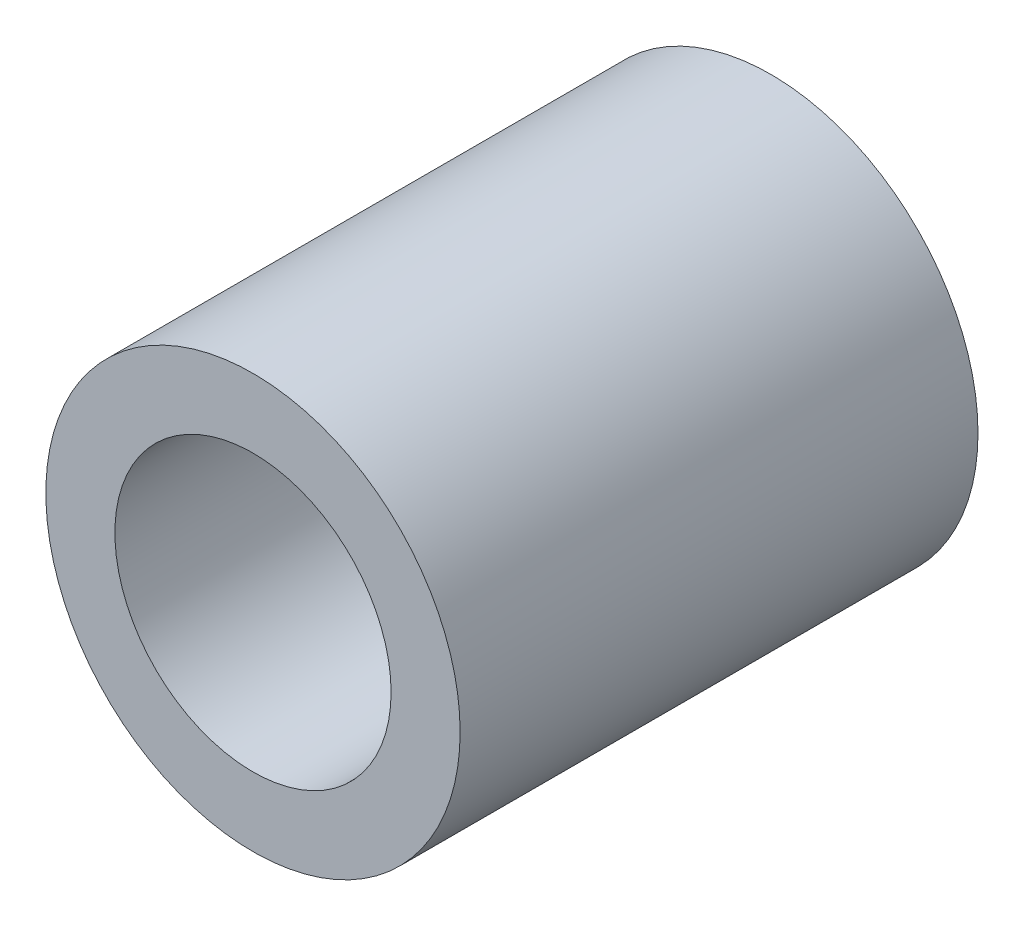
ISO-10303-21;
HEADER;
FILE_DESCRIPTION(('STEP AP214'),'2;1');
FILE_NAME('part.step','',(''),(''),'','','');
FILE_SCHEMA(('AUTOMOTIVE_DESIGN { 1 0 10303 214 1 1 1 1 }'));
ENDSEC;
DATA;
#1=APPLICATION_CONTEXT('core data for automotive mechanical design processes');
#2=APPLICATION_PROTOCOL_DEFINITION('international standard','automotive_design',2000,#1);
#3=PRODUCT_CONTEXT('',#1,'mechanical');
#4=PRODUCT('Part','Part','',(#3));
#5=PRODUCT_RELATED_PRODUCT_CATEGORY('part','',(#4));
#6=PRODUCT_DEFINITION_FORMATION('','',#4);
#7=PRODUCT_DEFINITION_CONTEXT('part definition',#1,'design');
#8=PRODUCT_DEFINITION('design','',#6,#7);
#9=PRODUCT_DEFINITION_SHAPE('','',#8);
#10=(LENGTH_UNIT() NAMED_UNIT(*) SI_UNIT(.MILLI.,.METRE.));
#11=(NAMED_UNIT(*) PLANE_ANGLE_UNIT() SI_UNIT($,.RADIAN.));
#12=(NAMED_UNIT(*) SI_UNIT($,.STERADIAN.) SOLID_ANGLE_UNIT());
#13=UNCERTAINTY_MEASURE_WITH_UNIT(LENGTH_MEASURE(1.E-05),#10,'distance_accuracy_value','');
#14=(GEOMETRIC_REPRESENTATION_CONTEXT(3) GLOBAL_UNCERTAINTY_ASSIGNED_CONTEXT((#13)) GLOBAL_UNIT_ASSIGNED_CONTEXT((#10,
#11,#12)) REPRESENTATION_CONTEXT('',''));
#15=CARTESIAN_POINT('',(0.,0.,0.));
#16=DIRECTION('',(0.,0.,1.));
#17=DIRECTION('',(1.,0.,0.));
#18=AXIS2_PLACEMENT_3D('',#15,#16,#17);
#19=CARTESIAN_POINT('',(0.,0.,30.));
#20=DIRECTION('',(0.,0.,1.));
#21=DIRECTION('',(1.,0.,0.));
#22=AXIS2_PLACEMENT_3D('',#19,#20,#21);
#23=PLANE('',#22);
#24=CARTESIAN_POINT('',(0.,0.,30.));
#25=DIRECTION('',(0.,0.,1.));
#26=DIRECTION('',(1.,0.,0.));
#27=AXIS2_PLACEMENT_3D('',#24,#25,#26);
#28=CIRCLE('',#27,12.);
#29=CARTESIAN_POINT('',(12.,0.,30.));
#30=VERTEX_POINT('',#29);
#31=EDGE_CURVE('E10',#30,#30,#28,.T.);
#32=ORIENTED_EDGE('',*,*,#31,.T.);
#33=EDGE_LOOP('',(#32));
#34=FACE_BOUND('',#33,.T.);
#35=CARTESIAN_POINT('',(0.,0.,30.));
#36=DIRECTION('',(0.,0.,1.));
#37=DIRECTION('',(1.,0.,0.));
#38=AXIS2_PLACEMENT_3D('',#35,#36,#37);
#39=CIRCLE('',#38,8.);
#40=CARTESIAN_POINT('',(8.,0.,30.));
#41=VERTEX_POINT('',#40);
#42=EDGE_CURVE('E50',#41,#41,#39,.T.);
#43=ORIENTED_EDGE('',*,*,#42,.F.);
#44=EDGE_LOOP('',(#43));
#45=FACE_BOUND('',#44,.T.);
#46=ADVANCED_FACE('F37',(#34,#45),#23,.T.);
#47=CARTESIAN_POINT('',(0.,0.,0.));
#48=DIRECTION('',(0.,0.,1.));
#49=DIRECTION('',(1.,0.,0.));
#50=AXIS2_PLACEMENT_3D('',#47,#48,#49);
#51=PLANE('',#50);
#52=CARTESIAN_POINT('',(0.,0.,0.));
#53=DIRECTION('',(0.,0.,1.));
#54=DIRECTION('',(1.,0.,0.));
#55=AXIS2_PLACEMENT_3D('',#52,#53,#54);
#56=CIRCLE('',#55,12.);
#57=CARTESIAN_POINT('',(12.,0.,0.));
#58=VERTEX_POINT('',#57);
#59=EDGE_CURVE('E41',#58,#58,#56,.T.);
#60=ORIENTED_EDGE('',*,*,#59,.F.);
#61=EDGE_LOOP('',(#60));
#62=FACE_BOUND('',#61,.T.);
#63=CARTESIAN_POINT('',(0.,0.,0.));
#64=DIRECTION('',(0.,0.,1.));
#65=DIRECTION('',(1.,0.,0.));
#66=AXIS2_PLACEMENT_3D('',#63,#64,#65);
#67=CIRCLE('',#66,8.);
#68=CARTESIAN_POINT('',(8.,0.,0.));
#69=VERTEX_POINT('',#68);
#70=EDGE_CURVE('E52',#69,#69,#67,.T.);
#71=ORIENTED_EDGE('',*,*,#70,.T.);
#72=EDGE_LOOP('',(#71));
#73=FACE_BOUND('',#72,.T.);
#74=ADVANCED_FACE('F64',(#62,#73),#51,.F.);
#75=CARTESIAN_POINT('',(0.,0.,30.));
#76=DIRECTION('',(0.,0.,-1.));
#77=DIRECTION('',(-1.,0.,0.));
#78=AXIS2_PLACEMENT_3D('',#75,#76,#77);
#79=CYLINDRICAL_SURFACE('',#78,12.);
#80=ORIENTED_EDGE('',*,*,#31,.F.);
#81=EDGE_LOOP('',(#80));
#82=FACE_BOUND('',#81,.T.);
#83=ORIENTED_EDGE('',*,*,#59,.T.);
#84=EDGE_LOOP('',(#83));
#85=FACE_BOUND('',#84,.T.);
#86=ADVANCED_FACE('F39',(#82,#85),#79,.T.);
#87=CARTESIAN_POINT('',(0.,0.,30.));
#88=DIRECTION('',(0.,0.,-1.));
#89=DIRECTION('',(-1.,0.,0.));
#90=AXIS2_PLACEMENT_3D('',#87,#88,#89);
#91=CYLINDRICAL_SURFACE('',#90,8.);
#92=ORIENTED_EDGE('',*,*,#42,.T.);
#93=EDGE_LOOP('',(#92));
#94=FACE_BOUND('',#93,.T.);
#95=ORIENTED_EDGE('',*,*,#70,.F.);
#96=EDGE_LOOP('',(#95));
#97=FACE_BOUND('',#96,.T.);
#98=ADVANCED_FACE('F60',(#94,#97),#91,.F.);
#99=CLOSED_SHELL('',(#46,#74,#86,#98));
#100=MANIFOLD_SOLID_BREP('B2',#99);
#101=ADVANCED_BREP_SHAPE_REPRESENTATION('',(#18,#100),#14);
#102=SHAPE_DEFINITION_REPRESENTATION(#9,#101);
ENDSEC;
END-ISO-10303-21;
